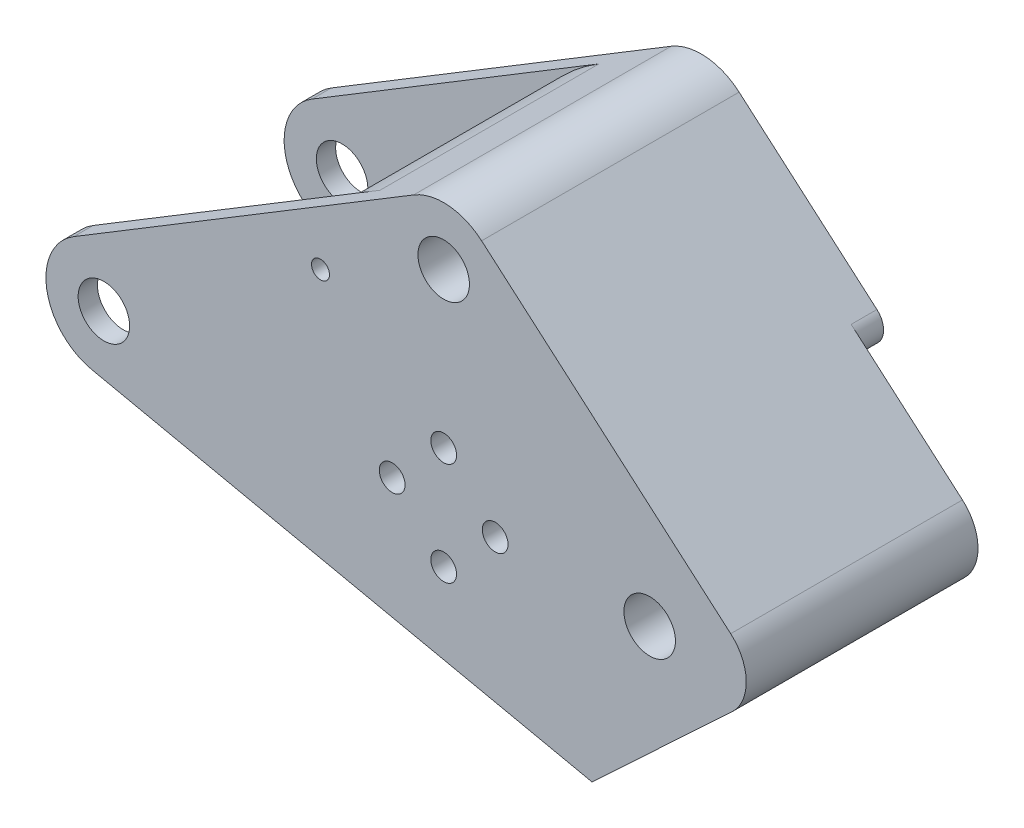
ISO-10303-21;
HEADER;
FILE_DESCRIPTION(('STEP AP214'),'2;1');
FILE_NAME('part.step','',(''),(''),'','','');
FILE_SCHEMA(('AUTOMOTIVE_DESIGN { 1 0 10303 214 1 1 1 1 }'));
ENDSEC;
DATA;
#1=APPLICATION_CONTEXT('core data for automotive mechanical design processes');
#2=APPLICATION_PROTOCOL_DEFINITION('international standard','automotive_design',2000,#1);
#3=PRODUCT_CONTEXT('',#1,'mechanical');
#4=PRODUCT('Part','Part','',(#3));
#5=PRODUCT_RELATED_PRODUCT_CATEGORY('part','',(#4));
#6=PRODUCT_DEFINITION_FORMATION('','',#4);
#7=PRODUCT_DEFINITION_CONTEXT('part definition',#1,'design');
#8=PRODUCT_DEFINITION('design','',#6,#7);
#9=PRODUCT_DEFINITION_SHAPE('','',#8);
#10=(LENGTH_UNIT() NAMED_UNIT(*) SI_UNIT(.MILLI.,.METRE.));
#11=(NAMED_UNIT(*) PLANE_ANGLE_UNIT() SI_UNIT($,.RADIAN.));
#12=(NAMED_UNIT(*) SI_UNIT($,.STERADIAN.) SOLID_ANGLE_UNIT());
#13=UNCERTAINTY_MEASURE_WITH_UNIT(LENGTH_MEASURE(1.E-05),#10,'distance_accuracy_value','');
#14=(GEOMETRIC_REPRESENTATION_CONTEXT(3) GLOBAL_UNCERTAINTY_ASSIGNED_CONTEXT((#13)) GLOBAL_UNIT_ASSIGNED_CONTEXT((#10,
#11,#12)) REPRESENTATION_CONTEXT('',''));
#15=CARTESIAN_POINT('',(0.,0.,0.));
#16=DIRECTION('',(0.,0.,1.));
#17=DIRECTION('',(1.,0.,0.));
#18=AXIS2_PLACEMENT_3D('',#15,#16,#17);
#19=CARTESIAN_POINT('',(92.7846096908264,0.,20.));
#20=DIRECTION('',(0.,0.,-1.));
#21=DIRECTION('',(-1.,0.,0.));
#22=AXIS2_PLACEMENT_3D('',#19,#20,#21);
#23=CYLINDRICAL_SURFACE('',#22,7.);
#24=CARTESIAN_POINT('',(92.7846096908264,0.,-16.));
#25=DIRECTION('',(0.,0.,-1.));
#26=DIRECTION('',(-1.,0.,0.));
#27=AXIS2_PLACEMENT_3D('',#24,#25,#26);
#28=CIRCLE('',#27,7.);
#29=CARTESIAN_POINT('',(97.3675554100697,5.29118214905415,-16.));
#30=VERTEX_POINT('',#29);
#31=CARTESIAN_POINT('',(97.5633187458234,-5.11506986928724,-16.));
#32=VERTEX_POINT('',#31);
#33=EDGE_CURVE('E147',#30,#32,#28,.T.);
#34=ORIENTED_EDGE('',*,*,#33,.F.);
#35=DIRECTION('',(0.,0.,-1.));
#36=VECTOR('',#35,1.);
#37=CARTESIAN_POINT('',(97.3675554100697,5.29118214905415,20.));
#38=LINE('',#37,#36);
#39=CARTESIAN_POINT('',(97.3675554100697,5.29118214905415,20.));
#40=VERTEX_POINT('',#39);
#41=EDGE_CURVE('E158',#40,#30,#38,.T.);
#42=ORIENTED_EDGE('',*,*,#41,.F.);
#43=CARTESIAN_POINT('',(92.7846096908264,0.,20.));
#44=DIRECTION('',(0.,0.,1.));
#45=DIRECTION('',(-1.,0.,0.));
#46=AXIS2_PLACEMENT_3D('',#43,#44,#45);
#47=CIRCLE('',#46,7.);
#48=CARTESIAN_POINT('',(97.5633187458234,-5.11506986928724,20.));
#49=VERTEX_POINT('',#48);
#50=EDGE_CURVE('E296',#49,#40,#47,.T.);
#51=ORIENTED_EDGE('',*,*,#50,.F.);
#52=DIRECTION('',(0.,0.,-1.));
#53=VECTOR('',#52,1.);
#54=CARTESIAN_POINT('',(97.5633187458234,-5.11506986928724,20.));
#55=LINE('',#54,#53);
#56=EDGE_CURVE('E161',#49,#32,#55,.T.);
#57=ORIENTED_EDGE('',*,*,#56,.T.);
#58=EDGE_LOOP('',(#34,#42,#51,#57));
#59=FACE_BOUND('',#58,.T.);
#60=ADVANCED_FACE('F40',(#59),#23,.T.);
#61=CARTESIAN_POINT('',(84.7846096908264,0.,20.));
#62=DIRECTION('',(0.,0.,-1.));
#63=DIRECTION('',(-1.,0.,0.));
#64=AXIS2_PLACEMENT_3D('',#61,#62,#63);
#65=CYLINDRICAL_SURFACE('',#64,4.00000000000001);
#66=CARTESIAN_POINT('',(84.7846096908264,0.,20.));
#67=DIRECTION('',(0.,0.,1.));
#68=DIRECTION('',(1.,0.,0.));
#69=AXIS2_PLACEMENT_3D('',#66,#67,#68);
#70=CIRCLE('',#69,4.00000000000001);
#71=CARTESIAN_POINT('',(88.7846096908264,0.,20.));
#72=VERTEX_POINT('',#71);
#73=EDGE_CURVE('E318',#72,#72,#70,.T.);
#74=ORIENTED_EDGE('',*,*,#73,.T.);
#75=EDGE_LOOP('',(#74));
#76=FACE_BOUND('',#75,.T.);
#77=CARTESIAN_POINT('',(84.7846096908264,0.,-16.));
#78=DIRECTION('',(0.,0.,-1.));
#79=DIRECTION('',(-1.,0.,0.));
#80=AXIS2_PLACEMENT_3D('',#77,#78,#79);
#81=CIRCLE('',#80,4.00000000000001);
#82=CARTESIAN_POINT('',(80.7846096908264,0.,-16.));
#83=VERTEX_POINT('',#82);
#84=EDGE_CURVE('E224',#83,#83,#81,.T.);
#85=ORIENTED_EDGE('',*,*,#84,.T.);
#86=EDGE_LOOP('',(#85));
#87=FACE_BOUND('',#86,.T.);
#88=ADVANCED_FACE('F474',(#76,#87),#65,.F.);
#89=CARTESIAN_POINT('',(60.7846096908264,0.,20.));
#90=DIRECTION('',(0.,0.,-1.));
#91=DIRECTION('',(-1.,0.,0.));
#92=AXIS2_PLACEMENT_3D('',#89,#90,#91);
#93=CYLINDRICAL_SURFACE('',#92,2.);
#94=CARTESIAN_POINT('',(60.7846096908264,0.,20.));
#95=DIRECTION('',(0.,0.,1.));
#96=DIRECTION('',(1.,0.,0.));
#97=AXIS2_PLACEMENT_3D('',#94,#95,#96);
#98=CIRCLE('',#97,2.);
#99=CARTESIAN_POINT('',(62.7846096908264,0.,20.));
#100=VERTEX_POINT('',#99);
#101=EDGE_CURVE('E325',#100,#100,#98,.T.);
#102=ORIENTED_EDGE('',*,*,#101,.T.);
#103=EDGE_LOOP('',(#102));
#104=FACE_BOUND('',#103,.T.);
#105=CARTESIAN_POINT('',(60.7846096908264,0.,17.));
#106=DIRECTION('',(0.,0.,-1.));
#107=DIRECTION('',(-1.,0.,0.));
#108=AXIS2_PLACEMENT_3D('',#105,#106,#107);
#109=CIRCLE('',#108,2.);
#110=CARTESIAN_POINT('',(58.7846096908264,0.,17.));
#111=VERTEX_POINT('',#110);
#112=EDGE_CURVE('E219',#111,#111,#109,.T.);
#113=ORIENTED_EDGE('',*,*,#112,.T.);
#114=EDGE_LOOP('',(#113));
#115=FACE_BOUND('',#114,.T.);
#116=ADVANCED_FACE('F480',(#104,#115),#93,.F.);
#117=CARTESIAN_POINT('',(52.7846096908264,-8.,20.));
#118=DIRECTION('',(0.,0.,-1.));
#119=DIRECTION('',(-1.,0.,0.));
#120=AXIS2_PLACEMENT_3D('',#117,#118,#119);
#121=CYLINDRICAL_SURFACE('',#120,2.);
#122=CARTESIAN_POINT('',(52.7846096908264,-8.,20.));
#123=DIRECTION('',(0.,0.,1.));
#124=DIRECTION('',(1.,0.,0.));
#125=AXIS2_PLACEMENT_3D('',#122,#123,#124);
#126=CIRCLE('',#125,2.);
#127=CARTESIAN_POINT('',(54.7846096908264,-8.,20.));
#128=VERTEX_POINT('',#127);
#129=EDGE_CURVE('E329',#128,#128,#126,.T.);
#130=ORIENTED_EDGE('',*,*,#129,.T.);
#131=EDGE_LOOP('',(#130));
#132=FACE_BOUND('',#131,.T.);
#133=CARTESIAN_POINT('',(52.7846096908264,-8.,17.));
#134=DIRECTION('',(0.,0.,-1.));
#135=DIRECTION('',(-1.,0.,0.));
#136=AXIS2_PLACEMENT_3D('',#133,#134,#135);
#137=CIRCLE('',#136,2.);
#138=CARTESIAN_POINT('',(50.7846096908264,-8.,17.));
#139=VERTEX_POINT('',#138);
#140=EDGE_CURVE('E215',#139,#139,#137,.T.);
#141=ORIENTED_EDGE('',*,*,#140,.T.);
#142=EDGE_LOOP('',(#141));
#143=FACE_BOUND('',#142,.T.);
#144=ADVANCED_FACE('F671',(#132,#143),#121,.F.);
#145=CARTESIAN_POINT('',(44.7846096908264,0.,20.));
#146=DIRECTION('',(0.,0.,-1.));
#147=DIRECTION('',(-1.,0.,0.));
#148=AXIS2_PLACEMENT_3D('',#145,#146,#147);
#149=CYLINDRICAL_SURFACE('',#148,2.);
#150=CARTESIAN_POINT('',(44.7846096908264,0.,20.));
#151=DIRECTION('',(0.,0.,1.));
#152=DIRECTION('',(1.,0.,0.));
#153=AXIS2_PLACEMENT_3D('',#150,#151,#152);
#154=CIRCLE('',#153,2.);
#155=CARTESIAN_POINT('',(46.7846096908264,0.,20.));
#156=VERTEX_POINT('',#155);
#157=EDGE_CURVE('E333',#156,#156,#154,.T.);
#158=ORIENTED_EDGE('',*,*,#157,.T.);
#159=EDGE_LOOP('',(#158));
#160=FACE_BOUND('',#159,.T.);
#161=CARTESIAN_POINT('',(44.7846096908264,0.,17.));
#162=DIRECTION('',(0.,0.,-1.));
#163=DIRECTION('',(-1.,0.,0.));
#164=AXIS2_PLACEMENT_3D('',#161,#162,#163);
#165=CIRCLE('',#164,2.);
#166=CARTESIAN_POINT('',(42.7846096908264,0.,17.));
#167=VERTEX_POINT('',#166);
#168=EDGE_CURVE('E210',#167,#167,#165,.T.);
#169=ORIENTED_EDGE('',*,*,#168,.T.);
#170=EDGE_LOOP('',(#169));
#171=FACE_BOUND('',#170,.T.);
#172=ADVANCED_FACE('F660',(#160,#171),#149,.F.);
#173=CARTESIAN_POINT('',(52.7846096908264,8.,20.));
#174=DIRECTION('',(0.,0.,-1.));
#175=DIRECTION('',(-1.,0.,0.));
#176=AXIS2_PLACEMENT_3D('',#173,#174,#175);
#177=CYLINDRICAL_SURFACE('',#176,2.);
#178=CARTESIAN_POINT('',(52.7846096908264,8.,20.));
#179=DIRECTION('',(0.,0.,1.));
#180=DIRECTION('',(1.,0.,0.));
#181=AXIS2_PLACEMENT_3D('',#178,#179,#180);
#182=CIRCLE('',#181,2.);
#183=CARTESIAN_POINT('',(54.7846096908264,8.,20.));
#184=VERTEX_POINT('',#183);
#185=EDGE_CURVE('E337',#184,#184,#182,.T.);
#186=ORIENTED_EDGE('',*,*,#185,.T.);
#187=EDGE_LOOP('',(#186));
#188=FACE_BOUND('',#187,.T.);
#189=CARTESIAN_POINT('',(52.7846096908264,8.,17.));
#190=DIRECTION('',(0.,0.,-1.));
#191=DIRECTION('',(-1.,0.,0.));
#192=AXIS2_PLACEMENT_3D('',#189,#190,#191);
#193=CIRCLE('',#192,2.);
#194=CARTESIAN_POINT('',(50.7846096908264,8.,17.));
#195=VERTEX_POINT('',#194);
#196=EDGE_CURVE('E206',#195,#195,#193,.T.);
#197=ORIENTED_EDGE('',*,*,#196,.T.);
#198=EDGE_LOOP('',(#197));
#199=FACE_BOUND('',#198,.T.);
#200=ADVANCED_FACE('F560',(#188,#199),#177,.F.);
#201=CARTESIAN_POINT('',(0.,0.,20.));
#202=DIRECTION('',(0.,0.,-1.));
#203=DIRECTION('',(-1.,0.,0.));
#204=AXIS2_PLACEMENT_3D('',#201,#202,#203);
#205=CYLINDRICAL_SURFACE('',#204,9.);
#206=CARTESIAN_POINT('',(0.,0.,17.));
#207=DIRECTION('',(0.,0.,-1.));
#208=DIRECTION('',(-1.,0.,0.));
#209=AXIS2_PLACEMENT_3D('',#206,#207,#208);
#210=CIRCLE('',#209,9.);
#211=CARTESIAN_POINT('',(-1.88266355773182,-8.80088506505957,17.));
#212=VERTEX_POINT('',#211);
#213=CARTESIAN_POINT('',(-4.66571004229143,7.69617760977883,17.));
#214=VERTEX_POINT('',#213);
#215=EDGE_CURVE('E369',#212,#214,#210,.T.);
#216=ORIENTED_EDGE('',*,*,#215,.F.);
#217=DIRECTION('',(0.,0.,-1.));
#218=VECTOR('',#217,1.);
#219=CARTESIAN_POINT('',(-1.88266355773182,-8.80088506505957,20.));
#220=LINE('',#219,#218);
#221=CARTESIAN_POINT('',(-1.88266355773182,-8.80088506505957,20.));
#222=VERTEX_POINT('',#221);
#223=EDGE_CURVE('E182',#222,#212,#220,.T.);
#224=ORIENTED_EDGE('',*,*,#223,.F.);
#225=CARTESIAN_POINT('',(0.,0.,20.));
#226=DIRECTION('',(0.,0.,1.));
#227=DIRECTION('',(1.,0.,0.));
#228=AXIS2_PLACEMENT_3D('',#225,#226,#227);
#229=CIRCLE('',#228,9.);
#230=CARTESIAN_POINT('',(-4.66571004229143,7.69617760977883,20.));
#231=VERTEX_POINT('',#230);
#232=EDGE_CURVE('E305',#231,#222,#229,.T.);
#233=ORIENTED_EDGE('',*,*,#232,.F.);
#234=DIRECTION('',(0.,0.,-1.));
#235=VECTOR('',#234,1.);
#236=CARTESIAN_POINT('',(-4.66571004229143,7.69617760977883,20.));
#237=LINE('',#236,#235);
#238=EDGE_CURVE('E187',#231,#214,#237,.T.);
#239=ORIENTED_EDGE('',*,*,#238,.T.);
#240=EDGE_LOOP('',(#216,#224,#233,#239));
#241=FACE_BOUND('',#240,.T.);
#242=ADVANCED_FACE('F453',(#241),#205,.T.);
#243=CARTESIAN_POINT('',(0.,0.,20.));
#244=DIRECTION('',(0.,0.,-1.));
#245=DIRECTION('',(-1.,0.,0.));
#246=AXIS2_PLACEMENT_3D('',#243,#244,#245);
#247=CYLINDRICAL_SURFACE('',#246,4.);
#248=CARTESIAN_POINT('',(0.,0.,20.));
#249=DIRECTION('',(0.,0.,1.));
#250=DIRECTION('',(1.,0.,0.));
#251=AXIS2_PLACEMENT_3D('',#248,#249,#250);
#252=CIRCLE('',#251,4.);
#253=CARTESIAN_POINT('',(4.,0.,20.));
#254=VERTEX_POINT('',#253);
#255=EDGE_CURVE('E293',#254,#254,#252,.T.);
#256=ORIENTED_EDGE('',*,*,#255,.T.);
#257=EDGE_LOOP('',(#256));
#258=FACE_BOUND('',#257,.T.);
#259=CARTESIAN_POINT('',(0.,0.,17.));
#260=DIRECTION('',(0.,0.,-1.));
#261=DIRECTION('',(-1.,0.,0.));
#262=AXIS2_PLACEMENT_3D('',#259,#260,#261);
#263=CIRCLE('',#262,4.);
#264=CARTESIAN_POINT('',(-4.,0.,17.));
#265=VERTEX_POINT('',#264);
#266=EDGE_CURVE('E196',#265,#265,#263,.T.);
#267=ORIENTED_EDGE('',*,*,#266,.T.);
#268=EDGE_LOOP('',(#267));
#269=FACE_BOUND('',#268,.T.);
#270=ADVANCED_FACE('F550',(#258,#269),#247,.F.);
#271=CARTESIAN_POINT('',(52.7846096908264,32.,20.));
#272=DIRECTION('',(0.,0.,-1.));
#273=DIRECTION('',(-1.,0.,0.));
#274=AXIS2_PLACEMENT_3D('',#271,#272,#273);
#275=PLANE('',#274);
#276=CARTESIAN_POINT('',(33.6505385165715,22.4274692323008,20.));
#277=DIRECTION('',(0.,0.,1.));
#278=DIRECTION('',(1.,0.,0.));
#279=AXIS2_PLACEMENT_3D('',#276,#277,#278);
#280=CIRCLE('',#279,1.395);
#281=CARTESIAN_POINT('',(35.0455385165715,22.4274692323008,20.));
#282=VERTEX_POINT('',#281);
#283=EDGE_CURVE('E228',#282,#282,#280,.T.);
#284=ORIENTED_EDGE('',*,*,#283,.F.);
#285=EDGE_LOOP('',(#284));
#286=FACE_BOUND('',#285,.T.);
#287=CARTESIAN_POINT('',(52.7846096908264,32.,20.));
#288=DIRECTION('',(0.,0.,1.));
#289=DIRECTION('',(-1.,0.,0.));
#290=AXIS2_PLACEMENT_3D('',#287,#288,#289);
#291=CIRCLE('',#290,9.);
#292=CARTESIAN_POINT('',(58.6769684727107,38.8029484773553,20.));
#293=VERTEX_POINT('',#292);
#294=CARTESIAN_POINT('',(48.118899648535,39.6961776097788,20.));
#295=VERTEX_POINT('',#294);
#296=EDGE_CURVE('E278',#293,#295,#291,.T.);
#297=ORIENTED_EDGE('',*,*,#296,.T.);
#298=DIRECTION('',(-0.855130845530981,-0.51841222692127,0.));
#299=VECTOR('',#298,1.);
#300=CARTESIAN_POINT('',(-4.66571004229143,7.69617760977883,20.));
#301=LINE('',#300,#299);
#302=EDGE_CURVE('E308',#295,#231,#301,.T.);
#303=ORIENTED_EDGE('',*,*,#302,.T.);
#304=ORIENTED_EDGE('',*,*,#232,.T.);
#305=DIRECTION('',(0.977876118339952,-0.20918483974798,0.));
#306=VECTOR('',#305,1.);
#307=CARTESIAN_POINT('',(-1.88266355773182,-8.80088506505957,20.));
#308=LINE('',#307,#306);
#309=CARTESIAN_POINT('',(75.8249885494009,-25.4239137374617,20.));
#310=VERTEX_POINT('',#309);
#311=EDGE_CURVE('E302',#222,#310,#308,.T.);
#312=ORIENTED_EDGE('',*,*,#311,.T.);
#313=DIRECTION('',(0.730724267041033,0.682672722142422,0.));
#314=VECTOR('',#313,1.);
#315=CARTESIAN_POINT('',(97.5633187458234,-5.11506986928723,20.));
#316=LINE('',#315,#314);
#317=EDGE_CURVE('E299',#310,#49,#316,.T.);
#318=ORIENTED_EDGE('',*,*,#317,.T.);
#319=ORIENTED_EDGE('',*,*,#50,.T.);
#320=DIRECTION('',(-0.755883164150593,0.654706531320475,0.));
#321=VECTOR('',#320,1.);
#322=CARTESIAN_POINT('',(58.6769684727107,38.8029484773553,20.));
#323=LINE('',#322,#321);
#324=EDGE_CURVE('E166',#40,#293,#323,.T.);
#325=ORIENTED_EDGE('',*,*,#324,.T.);
#326=EDGE_LOOP('',(#297,#303,#304,#312,#318,#319,#325));
#327=FACE_BOUND('',#326,.T.);
#328=ORIENTED_EDGE('',*,*,#255,.F.);
#329=EDGE_LOOP('',(#328));
#330=FACE_BOUND('',#329,.T.);
#331=ORIENTED_EDGE('',*,*,#73,.F.);
#332=EDGE_LOOP('',(#331));
#333=FACE_BOUND('',#332,.T.);
#334=ORIENTED_EDGE('',*,*,#101,.F.);
#335=EDGE_LOOP('',(#334));
#336=FACE_BOUND('',#335,.T.);
#337=ORIENTED_EDGE('',*,*,#129,.F.);
#338=EDGE_LOOP('',(#337));
#339=FACE_BOUND('',#338,.T.);
#340=ORIENTED_EDGE('',*,*,#157,.F.);
#341=EDGE_LOOP('',(#340));
#342=FACE_BOUND('',#341,.T.);
#343=ORIENTED_EDGE('',*,*,#185,.F.);
#344=EDGE_LOOP('',(#343));
#345=FACE_BOUND('',#344,.T.);
#346=CARTESIAN_POINT('',(52.7846096908264,32.,20.));
#347=DIRECTION('',(0.,0.,1.));
#348=DIRECTION('',(1.,0.,0.));
#349=AXIS2_PLACEMENT_3D('',#346,#347,#348);
#350=CIRCLE('',#349,4.00000000000001);
#351=CARTESIAN_POINT('',(56.7846096908264,32.,20.));
#352=VERTEX_POINT('',#351);
#353=EDGE_CURVE('E341',#352,#352,#350,.T.);
#354=ORIENTED_EDGE('',*,*,#353,.F.);
#355=EDGE_LOOP('',(#354));
#356=FACE_BOUND('',#355,.T.);
#357=ADVANCED_FACE('F431',(#286,#327,#330,#333,#336,#339,#342,#345,#356),#275,.F.);
#358=CARTESIAN_POINT('',(52.7846096908264,32.,-20.));
#359=DIRECTION('',(0.,0.,-1.));
#360=DIRECTION('',(-1.,0.,0.));
#361=AXIS2_PLACEMENT_3D('',#358,#359,#360);
#362=PLANE('',#361);
#363=CARTESIAN_POINT('',(84.7846096908264,0.,-20.));
#364=DIRECTION('',(0.,0.,-1.));
#365=DIRECTION('',(-1.,0.,0.));
#366=AXIS2_PLACEMENT_3D('',#363,#364,#365);
#367=CIRCLE('',#366,16.1898727620367);
#368=CARTESIAN_POINT('',(79.9414155285967,-15.4484772828225,-20.));
#369=VERTEX_POINT('',#368);
#370=CARTESIAN_POINT('',(79.1606317065131,15.1816616904375,-20.));
#371=VERTEX_POINT('',#370);
#372=EDGE_CURVE('E258',#369,#371,#367,.T.);
#373=ORIENTED_EDGE('',*,*,#372,.F.);
#374=CARTESIAN_POINT('',(79.0439666912742,-18.3110959413917,-20.));
#375=DIRECTION('',(0.,0.,-1.));
#376=DIRECTION('',(-1.,0.,0.));
#377=AXIS2_PLACEMENT_3D('',#374,#375,#376);
#378=CIRCLE('',#377,3.);
#379=CARTESIAN_POINT('',(81.0919848577015,-20.5032687425148,-20.));
#380=VERTEX_POINT('',#379);
#381=EDGE_CURVE('E238',#369,#380,#378,.T.);
#382=ORIENTED_EDGE('',*,*,#381,.T.);
#383=DIRECTION('',(0.730724267041033,0.682672722142422,0.));
#384=VECTOR('',#383,1.);
#385=CARTESIAN_POINT('',(97.5633187458234,-5.11506986928723,-20.));
#386=LINE('',#385,#384);
#387=CARTESIAN_POINT('',(75.8249885494009,-25.4239137374617,-20.));
#388=VERTEX_POINT('',#387);
#389=EDGE_CURVE('E267',#388,#380,#386,.T.);
#390=ORIENTED_EDGE('',*,*,#389,.F.);
#391=DIRECTION('',(0.977876118339952,-0.20918483974798,0.));
#392=VECTOR('',#391,1.);
#393=CARTESIAN_POINT('',(-1.88266355773182,-8.80088506505957,-20.));
#394=LINE('',#393,#392);
#395=CARTESIAN_POINT('',(-1.88266355773182,-8.80088506505957,-20.));
#396=VERTEX_POINT('',#395);
#397=EDGE_CURVE('E274',#396,#388,#394,.T.);
#398=ORIENTED_EDGE('',*,*,#397,.F.);
#399=CARTESIAN_POINT('',(0.,0.,-20.));
#400=DIRECTION('',(0.,0.,1.));
#401=DIRECTION('',(1.,0.,0.));
#402=AXIS2_PLACEMENT_3D('',#399,#400,#401);
#403=CIRCLE('',#402,9.);
#404=CARTESIAN_POINT('',(-4.66571004229143,7.69617760977883,-20.));
#405=VERTEX_POINT('',#404);
#406=EDGE_CURVE('E279',#405,#396,#403,.T.);
#407=ORIENTED_EDGE('',*,*,#406,.F.);
#408=DIRECTION('',(-0.855130845530981,-0.51841222692127,0.));
#409=VECTOR('',#408,1.);
#410=CARTESIAN_POINT('',(-4.66571004229143,7.69617760977883,-20.));
#411=LINE('',#410,#409);
#412=CARTESIAN_POINT('',(48.118899648535,39.6961776097788,-20.));
#413=VERTEX_POINT('',#412);
#414=EDGE_CURVE('E285',#413,#405,#411,.T.);
#415=ORIENTED_EDGE('',*,*,#414,.F.);
#416=CARTESIAN_POINT('',(52.7846096908264,32.,-20.));
#417=DIRECTION('',(0.,0.,1.));
#418=DIRECTION('',(-1.,0.,0.));
#419=AXIS2_PLACEMENT_3D('',#416,#417,#418);
#420=CIRCLE('',#419,9.);
#421=CARTESIAN_POINT('',(58.6769684727107,38.8029484773553,-20.));
#422=VERTEX_POINT('',#421);
#423=EDGE_CURVE('E289',#422,#413,#420,.T.);
#424=ORIENTED_EDGE('',*,*,#423,.F.);
#425=DIRECTION('',(-0.755883164150593,0.654706531320475,0.));
#426=VECTOR('',#425,1.);
#427=CARTESIAN_POINT('',(58.6769684727107,38.8029484773553,-20.));
#428=LINE('',#427,#426);
#429=CARTESIAN_POINT('',(80.0826224214569,20.2624886389907,-20.));
#430=VERTEX_POINT('',#429);
#431=EDGE_CURVE('E273',#430,#422,#428,.T.);
#432=ORIENTED_EDGE('',*,*,#431,.F.);
#433=CARTESIAN_POINT('',(78.1185028274955,17.9948391465389,-20.));
#434=DIRECTION('',(0.,0.,-1.));
#435=DIRECTION('',(-1.,0.,0.));
#436=AXIS2_PLACEMENT_3D('',#433,#434,#435);
#437=CIRCLE('',#436,3.);
#438=EDGE_CURVE('E235',#430,#371,#437,.T.);
#439=ORIENTED_EDGE('',*,*,#438,.T.);
#440=EDGE_LOOP('',(#373,#382,#390,#398,#407,#415,#424,#432,#439));
#441=FACE_BOUND('',#440,.T.);
#442=CARTESIAN_POINT('',(33.6505385165715,22.4274692323008,-20.));
#443=DIRECTION('',(0.,0.,1.));
#444=DIRECTION('',(1.,0.,0.));
#445=AXIS2_PLACEMENT_3D('',#442,#443,#444);
#446=CIRCLE('',#445,1.395);
#447=CARTESIAN_POINT('',(35.0455385165715,22.4274692323008,-20.));
#448=VERTEX_POINT('',#447);
#449=EDGE_CURVE('E412',#448,#448,#446,.T.);
#450=ORIENTED_EDGE('',*,*,#449,.T.);
#451=EDGE_LOOP('',(#450));
#452=FACE_BOUND('',#451,.T.);
#453=CARTESIAN_POINT('',(44.7846096908264,0.,-20.));
#454=DIRECTION('',(0.,0.,-1.));
#455=DIRECTION('',(-1.,0.,0.));
#456=AXIS2_PLACEMENT_3D('',#453,#454,#455);
#457=CIRCLE('',#456,4.00000000000001);
#458=CARTESIAN_POINT('',(40.7846096908264,0.,-20.));
#459=VERTEX_POINT('',#458);
#460=EDGE_CURVE('E400',#459,#459,#457,.T.);
#461=ORIENTED_EDGE('',*,*,#460,.F.);
#462=EDGE_LOOP('',(#461));
#463=FACE_BOUND('',#462,.T.);
#464=CARTESIAN_POINT('',(52.7846096908264,-8.,-20.));
#465=DIRECTION('',(0.,0.,-1.));
#466=DIRECTION('',(-1.,0.,0.));
#467=AXIS2_PLACEMENT_3D('',#464,#465,#466);
#468=CIRCLE('',#467,4.00000000000001);
#469=CARTESIAN_POINT('',(48.7846096908264,-8.,-20.));
#470=VERTEX_POINT('',#469);
#471=EDGE_CURVE('E392',#470,#470,#468,.T.);
#472=ORIENTED_EDGE('',*,*,#471,.F.);
#473=EDGE_LOOP('',(#472));
#474=FACE_BOUND('',#473,.T.);
#475=CARTESIAN_POINT('',(52.7846096908264,8.,-20.));
#476=DIRECTION('',(0.,0.,-1.));
#477=DIRECTION('',(-1.,0.,0.));
#478=AXIS2_PLACEMENT_3D('',#475,#476,#477);
#479=CIRCLE('',#478,4.00000000000001);
#480=CARTESIAN_POINT('',(48.7846096908264,8.,-20.));
#481=VERTEX_POINT('',#480);
#482=EDGE_CURVE('E408',#481,#481,#479,.T.);
#483=ORIENTED_EDGE('',*,*,#482,.F.);
#484=EDGE_LOOP('',(#483));
#485=FACE_BOUND('',#484,.T.);
#486=CARTESIAN_POINT('',(60.7846096908264,0.,-20.));
#487=DIRECTION('',(0.,0.,-1.));
#488=DIRECTION('',(-1.,0.,0.));
#489=AXIS2_PLACEMENT_3D('',#486,#487,#488);
#490=CIRCLE('',#489,4.00000000000001);
#491=CARTESIAN_POINT('',(56.7846096908264,0.,-20.));
#492=VERTEX_POINT('',#491);
#493=EDGE_CURVE('E384',#492,#492,#490,.T.);
#494=ORIENTED_EDGE('',*,*,#493,.F.);
#495=EDGE_LOOP('',(#494));
#496=FACE_BOUND('',#495,.T.);
#497=CARTESIAN_POINT('',(0.,0.,-20.));
#498=DIRECTION('',(0.,0.,1.));
#499=DIRECTION('',(1.,0.,0.));
#500=AXIS2_PLACEMENT_3D('',#497,#498,#499);
#501=CIRCLE('',#500,4.);
#502=CARTESIAN_POINT('',(4.,0.,-20.));
#503=VERTEX_POINT('',#502);
#504=EDGE_CURVE('E314',#503,#503,#501,.T.);
#505=ORIENTED_EDGE('',*,*,#504,.T.);
#506=EDGE_LOOP('',(#505));
#507=FACE_BOUND('',#506,.T.);
#508=CARTESIAN_POINT('',(52.7846096908264,32.,-20.));
#509=DIRECTION('',(0.,0.,1.));
#510=DIRECTION('',(1.,0.,0.));
#511=AXIS2_PLACEMENT_3D('',#508,#509,#510);
#512=CIRCLE('',#511,4.00000000000001);
#513=CARTESIAN_POINT('',(56.7846096908264,32.,-20.));
#514=VERTEX_POINT('',#513);
#515=EDGE_CURVE('E205',#514,#514,#512,.T.);
#516=ORIENTED_EDGE('',*,*,#515,.T.);
#517=EDGE_LOOP('',(#516));
#518=FACE_BOUND('',#517,.T.);
#519=ADVANCED_FACE('F264',(#441,#452,#463,#474,#485,#496,#507,#518),#362,.T.);
#520=CARTESIAN_POINT('',(52.7846096908264,32.,20.));
#521=DIRECTION('',(0.,0.,-1.));
#522=DIRECTION('',(-1.,0.,0.));
#523=AXIS2_PLACEMENT_3D('',#520,#521,#522);
#524=CYLINDRICAL_SURFACE('',#523,9.);
#525=ORIENTED_EDGE('',*,*,#423,.T.);
#526=DIRECTION('',(0.,0.,-1.));
#527=VECTOR('',#526,1.);
#528=CARTESIAN_POINT('',(48.118899648535,39.6961776097788,20.));
#529=LINE('',#528,#527);
#530=EDGE_CURVE('E191',#295,#413,#529,.T.);
#531=ORIENTED_EDGE('',*,*,#530,.F.);
#532=ORIENTED_EDGE('',*,*,#296,.F.);
#533=DIRECTION('',(0.,0.,-1.));
#534=VECTOR('',#533,1.);
#535=CARTESIAN_POINT('',(58.6769684727107,38.8029484773553,20.));
#536=LINE('',#535,#534);
#537=EDGE_CURVE('E168',#293,#422,#536,.T.);
#538=ORIENTED_EDGE('',*,*,#537,.T.);
#539=EDGE_LOOP('',(#525,#531,#532,#538));
#540=FACE_BOUND('',#539,.T.);
#541=ADVANCED_FACE('F428',(#540),#524,.T.);
#542=CARTESIAN_POINT('',(-4.66571004229143,7.69617760977883,20.));
#543=DIRECTION('',(0.51841222692127,-0.855130845530981,0.));
#544=DIRECTION('',(0.855130845530981,0.51841222692127,0.));
#545=AXIS2_PLACEMENT_3D('',#542,#543,#544);
#546=PLANE('',#545);
#547=CARTESIAN_POINT('',(-4.66571004229143,7.69617760977883,-17.));
#548=VERTEX_POINT('',#547);
#549=EDGE_CURVE('E186',#548,#405,#237,.T.);
#550=ORIENTED_EDGE('',*,*,#549,.F.);
#551=DIRECTION('',(-0.855130845530981,-0.51841222692127,0.));
#552=VECTOR('',#551,1.);
#553=CARTESIAN_POINT('',(-4.66571004229143,7.69617760977883,-17.));
#554=LINE('',#553,#552);
#555=CARTESIAN_POINT('',(39.8918886883294,34.7086565829381,-17.));
#556=VERTEX_POINT('',#555);
#557=EDGE_CURVE('E358',#556,#548,#554,.T.);
#558=ORIENTED_EDGE('',*,*,#557,.F.);
#559=DIRECTION('',(0.,0.,1.));
#560=VECTOR('',#559,1.);
#561=CARTESIAN_POINT('',(39.8918886883294,34.7086565829381,-99.5775573065256));
#562=LINE('',#561,#560);
#563=CARTESIAN_POINT('',(39.8918886883294,34.7086565829381,17.));
#564=VERTEX_POINT('',#563);
#565=EDGE_CURVE('E354',#556,#564,#562,.T.);
#566=ORIENTED_EDGE('',*,*,#565,.T.);
#567=DIRECTION('',(0.855130845530981,0.51841222692127,0.));
#568=VECTOR('',#567,1.);
#569=CARTESIAN_POINT('',(-4.66571004229143,7.69617760977883,17.));
#570=LINE('',#569,#568);
#571=EDGE_CURVE('E223',#214,#564,#570,.T.);
#572=ORIENTED_EDGE('',*,*,#571,.F.);
#573=ORIENTED_EDGE('',*,*,#238,.F.);
#574=ORIENTED_EDGE('',*,*,#302,.F.);
#575=ORIENTED_EDGE('',*,*,#530,.T.);
#576=ORIENTED_EDGE('',*,*,#414,.T.);
#577=EDGE_LOOP('',(#550,#558,#566,#572,#573,#574,#575,#576));
#578=FACE_BOUND('',#577,.T.);
#579=ADVANCED_FACE('F449',(#578),#546,.F.);
#580=CARTESIAN_POINT('',(-1.88266355773182,-8.80088506505957,-17.));
#581=VERTEX_POINT('',#580);
#582=EDGE_CURVE('E181',#581,#396,#220,.T.);
#583=ORIENTED_EDGE('',*,*,#582,.F.);
#584=CARTESIAN_POINT('',(0.,0.,-17.));
#585=DIRECTION('',(0.,0.,-1.));
#586=DIRECTION('',(-1.,0.,0.));
#587=AXIS2_PLACEMENT_3D('',#584,#585,#586);
#588=CIRCLE('',#587,9.);
#589=EDGE_CURVE('E201',#548,#581,#588,.F.);
#590=ORIENTED_EDGE('',*,*,#589,.F.);
#591=ORIENTED_EDGE('',*,*,#549,.T.);
#592=ORIENTED_EDGE('',*,*,#406,.T.);
#593=EDGE_LOOP('',(#583,#590,#591,#592));
#594=FACE_BOUND('',#593,.T.);
#595=ADVANCED_FACE('F443',(#594),#205,.T.);
#596=CARTESIAN_POINT('',(-1.88266355773182,-8.80088506505957,20.));
#597=DIRECTION('',(0.20918483974798,0.977876118339952,0.));
#598=DIRECTION('',(-0.977876118339952,0.20918483974798,0.));
#599=AXIS2_PLACEMENT_3D('',#596,#597,#598);
#600=PLANE('',#599);
#601=DIRECTION('',(0.,0.,1.));
#602=VECTOR('',#601,1.);
#603=CARTESIAN_POINT('',(49.0707220170727,-19.7007072369894,-99.5775573065256));
#604=LINE('',#603,#602);
#605=CARTESIAN_POINT('',(49.0707220170727,-19.7007072369894,-17.));
#606=VERTEX_POINT('',#605);
#607=CARTESIAN_POINT('',(49.0707220170727,-19.7007072369894,17.));
#608=VERTEX_POINT('',#607);
#609=EDGE_CURVE('E348',#606,#608,#604,.T.);
#610=ORIENTED_EDGE('',*,*,#609,.F.);
#611=DIRECTION('',(0.977876118339952,-0.20918483974798,0.));
#612=VECTOR('',#611,1.);
#613=CARTESIAN_POINT('',(-1.88266355773182,-8.80088506505957,-17.));
#614=LINE('',#613,#612);
#615=EDGE_CURVE('E353',#581,#606,#614,.T.);
#616=ORIENTED_EDGE('',*,*,#615,.F.);
#617=ORIENTED_EDGE('',*,*,#582,.T.);
#618=ORIENTED_EDGE('',*,*,#397,.T.);
#619=DIRECTION('',(0.,0.,-1.));
#620=VECTOR('',#619,1.);
#621=CARTESIAN_POINT('',(75.8249885494009,-25.4239137374617,20.));
#622=LINE('',#621,#620);
#623=EDGE_CURVE('E172',#310,#388,#622,.T.);
#624=ORIENTED_EDGE('',*,*,#623,.F.);
#625=ORIENTED_EDGE('',*,*,#311,.F.);
#626=ORIENTED_EDGE('',*,*,#223,.T.);
#627=DIRECTION('',(-0.977876118339952,0.20918483974798,0.));
#628=VECTOR('',#627,1.);
#629=CARTESIAN_POINT('',(-1.88266355773182,-8.80088506505957,17.));
#630=LINE('',#629,#628);
#631=EDGE_CURVE('E376',#608,#212,#630,.T.);
#632=ORIENTED_EDGE('',*,*,#631,.F.);
#633=EDGE_LOOP('',(#610,#616,#617,#618,#624,#625,#626,#632));
#634=FACE_BOUND('',#633,.T.);
#635=ADVANCED_FACE('F439',(#634),#600,.F.);
#636=CARTESIAN_POINT('',(97.5633187458234,-5.11506986928723,20.));
#637=DIRECTION('',(-0.682672722142422,0.730724267041033,0.));
#638=DIRECTION('',(-0.730724267041033,-0.682672722142422,0.));
#639=AXIS2_PLACEMENT_3D('',#636,#637,#638);
#640=PLANE('',#639);
#641=ORIENTED_EDGE('',*,*,#389,.T.);
#642=DIRECTION('',(0.,0.,-1.));
#643=VECTOR('',#642,1.);
#644=CARTESIAN_POINT('',(81.0919848577015,-20.5032687425148,20.));
#645=LINE('',#644,#643);
#646=CARTESIAN_POINT('',(81.0919848577015,-20.5032687425148,-16.));
#647=VERTEX_POINT('',#646);
#648=EDGE_CURVE('E241',#380,#647,#645,.F.);
#649=ORIENTED_EDGE('',*,*,#648,.T.);
#650=DIRECTION('',(-0.730724267041033,-0.682672722142422,0.));
#651=VECTOR('',#650,1.);
#652=CARTESIAN_POINT('',(97.5633187458234,-5.11506986928724,-16.));
#653=LINE('',#652,#651);
#654=EDGE_CURVE('E63',#32,#647,#653,.T.);
#655=ORIENTED_EDGE('',*,*,#654,.F.);
#656=ORIENTED_EDGE('',*,*,#56,.F.);
#657=ORIENTED_EDGE('',*,*,#317,.F.);
#658=ORIENTED_EDGE('',*,*,#623,.T.);
#659=EDGE_LOOP('',(#641,#649,#655,#656,#657,#658));
#660=FACE_BOUND('',#659,.T.);
#661=ADVANCED_FACE('F269',(#660),#640,.F.);
#662=CARTESIAN_POINT('',(58.6769684727107,38.8029484773553,20.));
#663=DIRECTION('',(-0.654706531320475,-0.755883164150593,0.));
#664=DIRECTION('',(0.755883164150593,-0.654706531320475,0.));
#665=AXIS2_PLACEMENT_3D('',#662,#663,#664);
#666=PLANE('',#665);
#667=DIRECTION('',(0.755883164150593,-0.654706531320475,0.));
#668=VECTOR('',#667,1.);
#669=CARTESIAN_POINT('',(97.3675554100697,5.29118214905415,-16.));
#670=LINE('',#669,#668);
#671=CARTESIAN_POINT('',(80.0826224214569,20.2624886389907,-16.));
#672=VERTEX_POINT('',#671);
#673=EDGE_CURVE('E56',#672,#30,#670,.T.);
#674=ORIENTED_EDGE('',*,*,#673,.F.);
#675=DIRECTION('',(0.,0.,-1.));
#676=VECTOR('',#675,1.);
#677=CARTESIAN_POINT('',(80.0826224214569,20.2624886389907,20.));
#678=LINE('',#677,#676);
#679=EDGE_CURVE('E244',#672,#430,#678,.T.);
#680=ORIENTED_EDGE('',*,*,#679,.T.);
#681=ORIENTED_EDGE('',*,*,#431,.T.);
#682=ORIENTED_EDGE('',*,*,#537,.F.);
#683=ORIENTED_EDGE('',*,*,#324,.F.);
#684=ORIENTED_EDGE('',*,*,#41,.T.);
#685=EDGE_LOOP('',(#674,#680,#681,#682,#683,#684));
#686=FACE_BOUND('',#685,.T.);
#687=ADVANCED_FACE('F164',(#686),#666,.F.);
#688=CARTESIAN_POINT('',(0.,0.,-17.));
#689=DIRECTION('',(0.,0.,-1.));
#690=DIRECTION('',(-1.,0.,0.));
#691=AXIS2_PLACEMENT_3D('',#688,#689,#690);
#692=CIRCLE('',#691,4.);
#693=CARTESIAN_POINT('',(-4.,0.,-17.));
#694=VERTEX_POINT('',#693);
#695=EDGE_CURVE('E200',#694,#694,#692,.T.);
#696=ORIENTED_EDGE('',*,*,#695,.F.);
#697=EDGE_LOOP('',(#696));
#698=FACE_BOUND('',#697,.T.);
#699=ORIENTED_EDGE('',*,*,#504,.F.);
#700=EDGE_LOOP('',(#699));
#701=FACE_BOUND('',#700,.T.);
#702=ADVANCED_FACE('F470',(#698,#701),#247,.F.);
#703=CARTESIAN_POINT('',(52.7846096908264,32.,20.));
#704=DIRECTION('',(0.,0.,-1.));
#705=DIRECTION('',(-1.,0.,0.));
#706=AXIS2_PLACEMENT_3D('',#703,#704,#705);
#707=CYLINDRICAL_SURFACE('',#706,4.00000000000001);
#708=ORIENTED_EDGE('',*,*,#353,.T.);
#709=EDGE_LOOP('',(#708));
#710=FACE_BOUND('',#709,.T.);
#711=ORIENTED_EDGE('',*,*,#515,.F.);
#712=EDGE_LOOP('',(#711));
#713=FACE_BOUND('',#712,.T.);
#714=ADVANCED_FACE('F462',(#710,#713),#707,.F.);
#715=CARTESIAN_POINT('',(52.7846096908264,32.,-17.));
#716=DIRECTION('',(0.,0.,-1.));
#717=DIRECTION('',(-1.,0.,0.));
#718=AXIS2_PLACEMENT_3D('',#715,#716,#717);
#719=PLANE('',#718);
#720=ORIENTED_EDGE('',*,*,#695,.T.);
#721=EDGE_LOOP('',(#720));
#722=FACE_BOUND('',#721,.T.);
#723=ORIENTED_EDGE('',*,*,#589,.T.);
#724=ORIENTED_EDGE('',*,*,#615,.T.);
#725=CARTESIAN_POINT('',(55.279980506427,9.32570594216057,-17.));
#726=DIRECTION('',(0.,0.,-1.));
#727=DIRECTION('',(-1.,0.,0.));
#728=AXIS2_PLACEMENT_3D('',#725,#726,#727);
#729=CIRCLE('',#728,29.6831189910082);
#730=EDGE_CURVE('E352',#606,#556,#729,.T.);
#731=ORIENTED_EDGE('',*,*,#730,.T.);
#732=ORIENTED_EDGE('',*,*,#557,.T.);
#733=EDGE_LOOP('',(#723,#724,#731,#732));
#734=FACE_BOUND('',#733,.T.);
#735=ADVANCED_FACE('F460',(#722,#734),#719,.F.);
#736=CARTESIAN_POINT('',(55.279980506427,9.32570594216057,-99.5775573065256));
#737=DIRECTION('',(0.,0.,1.));
#738=DIRECTION('',(1.,0.,0.));
#739=AXIS2_PLACEMENT_3D('',#736,#737,#738);
#740=CYLINDRICAL_SURFACE('',#739,29.6831189910082);
#741=ORIENTED_EDGE('',*,*,#609,.T.);
#742=CARTESIAN_POINT('',(55.279980506427,9.32570594216057,17.));
#743=DIRECTION('',(0.,0.,-1.));
#744=DIRECTION('',(-1.,0.,0.));
#745=AXIS2_PLACEMENT_3D('',#742,#743,#744);
#746=CIRCLE('',#745,29.6831189910082);
#747=EDGE_CURVE('E373',#564,#608,#746,.F.);
#748=ORIENTED_EDGE('',*,*,#747,.F.);
#749=ORIENTED_EDGE('',*,*,#565,.F.);
#750=ORIENTED_EDGE('',*,*,#730,.F.);
#751=EDGE_LOOP('',(#741,#748,#749,#750));
#752=FACE_BOUND('',#751,.T.);
#753=ADVANCED_FACE('F458',(#752),#740,.T.);
#754=CARTESIAN_POINT('',(52.7846096908264,32.,17.));
#755=DIRECTION('',(0.,0.,-1.));
#756=DIRECTION('',(-1.,0.,0.));
#757=AXIS2_PLACEMENT_3D('',#754,#755,#756);
#758=PLANE('',#757);
#759=ORIENTED_EDGE('',*,*,#266,.F.);
#760=EDGE_LOOP('',(#759));
#761=FACE_BOUND('',#760,.T.);
#762=ORIENTED_EDGE('',*,*,#631,.T.);
#763=ORIENTED_EDGE('',*,*,#215,.T.);
#764=ORIENTED_EDGE('',*,*,#571,.T.);
#765=ORIENTED_EDGE('',*,*,#747,.T.);
#766=EDGE_LOOP('',(#762,#763,#764,#765));
#767=FACE_BOUND('',#766,.T.);
#768=ADVANCED_FACE('F456',(#761,#767),#758,.T.);
#769=CARTESIAN_POINT('',(52.7846096908264,8.,31.3137084989848));
#770=DIRECTION('',(0.,0.,-1.));
#771=DIRECTION('',(-1.,0.,0.));
#772=AXIS2_PLACEMENT_3D('',#769,#770,#771);
#773=CYLINDRICAL_SURFACE('',#772,4.00000000000001);
#774=CARTESIAN_POINT('',(52.7846096908264,8.,17.));
#775=DIRECTION('',(0.,0.,-1.));
#776=DIRECTION('',(-1.,0.,0.));
#777=AXIS2_PLACEMENT_3D('',#774,#775,#776);
#778=CIRCLE('',#777,4.00000000000001);
#779=CARTESIAN_POINT('',(48.7846096908264,8.,17.));
#780=VERTEX_POINT('',#779);
#781=EDGE_CURVE('E404',#780,#780,#778,.F.);
#782=ORIENTED_EDGE('',*,*,#781,.T.);
#783=EDGE_LOOP('',(#782));
#784=FACE_BOUND('',#783,.T.);
#785=ORIENTED_EDGE('',*,*,#482,.T.);
#786=EDGE_LOOP('',(#785));
#787=FACE_BOUND('',#786,.T.);
#788=ADVANCED_FACE('F517',(#784,#787),#773,.F.);
#789=CARTESIAN_POINT('',(52.7846096908264,32.,17.));
#790=DIRECTION('',(0.,0.,-1.));
#791=DIRECTION('',(-1.,0.,0.));
#792=AXIS2_PLACEMENT_3D('',#789,#790,#791);
#793=PLANE('',#792);
#794=ORIENTED_EDGE('',*,*,#196,.F.);
#795=EDGE_LOOP('',(#794));
#796=FACE_BOUND('',#795,.T.);
#797=ORIENTED_EDGE('',*,*,#781,.F.);
#798=EDGE_LOOP('',(#797));
#799=FACE_BOUND('',#798,.T.);
#800=ADVANCED_FACE('F513',(#796,#799),#793,.T.);
#801=CARTESIAN_POINT('',(44.7846096908264,0.,31.3137084989848));
#802=DIRECTION('',(0.,0.,-1.));
#803=DIRECTION('',(-1.,0.,0.));
#804=AXIS2_PLACEMENT_3D('',#801,#802,#803);
#805=CYLINDRICAL_SURFACE('',#804,4.00000000000001);
#806=CARTESIAN_POINT('',(44.7846096908264,0.,17.));
#807=DIRECTION('',(0.,0.,-1.));
#808=DIRECTION('',(-1.,0.,0.));
#809=AXIS2_PLACEMENT_3D('',#806,#807,#808);
#810=CIRCLE('',#809,4.00000000000001);
#811=CARTESIAN_POINT('',(40.7846096908264,0.,17.));
#812=VERTEX_POINT('',#811);
#813=EDGE_CURVE('E396',#812,#812,#810,.F.);
#814=ORIENTED_EDGE('',*,*,#813,.T.);
#815=EDGE_LOOP('',(#814));
#816=FACE_BOUND('',#815,.T.);
#817=ORIENTED_EDGE('',*,*,#460,.T.);
#818=EDGE_LOOP('',(#817));
#819=FACE_BOUND('',#818,.T.);
#820=ADVANCED_FACE('F516',(#816,#819),#805,.F.);
#821=CARTESIAN_POINT('',(52.7846096908264,32.,17.));
#822=DIRECTION('',(0.,0.,-1.));
#823=DIRECTION('',(-1.,0.,0.));
#824=AXIS2_PLACEMENT_3D('',#821,#822,#823);
#825=PLANE('',#824);
#826=ORIENTED_EDGE('',*,*,#168,.F.);
#827=EDGE_LOOP('',(#826));
#828=FACE_BOUND('',#827,.T.);
#829=ORIENTED_EDGE('',*,*,#813,.F.);
#830=EDGE_LOOP('',(#829));
#831=FACE_BOUND('',#830,.T.);
#832=ADVANCED_FACE('F522',(#828,#831),#825,.T.);
#833=CARTESIAN_POINT('',(52.7846096908264,-8.,31.3137084989848));
#834=DIRECTION('',(0.,0.,-1.));
#835=DIRECTION('',(-1.,0.,0.));
#836=AXIS2_PLACEMENT_3D('',#833,#834,#835);
#837=CYLINDRICAL_SURFACE('',#836,4.00000000000001);
#838=CARTESIAN_POINT('',(52.7846096908264,-8.,17.));
#839=DIRECTION('',(0.,0.,-1.));
#840=DIRECTION('',(-1.,0.,0.));
#841=AXIS2_PLACEMENT_3D('',#838,#839,#840);
#842=CIRCLE('',#841,4.00000000000001);
#843=CARTESIAN_POINT('',(48.7846096908264,-8.,17.));
#844=VERTEX_POINT('',#843);
#845=EDGE_CURVE('E388',#844,#844,#842,.F.);
#846=ORIENTED_EDGE('',*,*,#845,.T.);
#847=EDGE_LOOP('',(#846));
#848=FACE_BOUND('',#847,.T.);
#849=ORIENTED_EDGE('',*,*,#471,.T.);
#850=EDGE_LOOP('',(#849));
#851=FACE_BOUND('',#850,.T.);
#852=ADVANCED_FACE('F525',(#848,#851),#837,.F.);
#853=CARTESIAN_POINT('',(52.7846096908264,32.,17.));
#854=DIRECTION('',(0.,0.,-1.));
#855=DIRECTION('',(-1.,0.,0.));
#856=AXIS2_PLACEMENT_3D('',#853,#854,#855);
#857=PLANE('',#856);
#858=ORIENTED_EDGE('',*,*,#140,.F.);
#859=EDGE_LOOP('',(#858));
#860=FACE_BOUND('',#859,.T.);
#861=ORIENTED_EDGE('',*,*,#845,.F.);
#862=EDGE_LOOP('',(#861));
#863=FACE_BOUND('',#862,.T.);
#864=ADVANCED_FACE('F530',(#860,#863),#857,.T.);
#865=CARTESIAN_POINT('',(60.7846096908264,0.,31.3137084989848));
#866=DIRECTION('',(0.,0.,-1.));
#867=DIRECTION('',(-1.,0.,0.));
#868=AXIS2_PLACEMENT_3D('',#865,#866,#867);
#869=CYLINDRICAL_SURFACE('',#868,4.00000000000001);
#870=CARTESIAN_POINT('',(60.7846096908264,0.,17.));
#871=DIRECTION('',(0.,0.,-1.));
#872=DIRECTION('',(-1.,0.,0.));
#873=AXIS2_PLACEMENT_3D('',#870,#871,#872);
#874=CIRCLE('',#873,4.00000000000001);
#875=CARTESIAN_POINT('',(56.7846096908264,0.,17.));
#876=VERTEX_POINT('',#875);
#877=EDGE_CURVE('E211',#876,#876,#874,.F.);
#878=ORIENTED_EDGE('',*,*,#877,.T.);
#879=EDGE_LOOP('',(#878));
#880=FACE_BOUND('',#879,.T.);
#881=ORIENTED_EDGE('',*,*,#493,.T.);
#882=EDGE_LOOP('',(#881));
#883=FACE_BOUND('',#882,.T.);
#884=ADVANCED_FACE('F533',(#880,#883),#869,.F.);
#885=CARTESIAN_POINT('',(52.7846096908264,32.,17.));
#886=DIRECTION('',(0.,0.,-1.));
#887=DIRECTION('',(-1.,0.,0.));
#888=AXIS2_PLACEMENT_3D('',#885,#886,#887);
#889=PLANE('',#888);
#890=ORIENTED_EDGE('',*,*,#112,.F.);
#891=EDGE_LOOP('',(#890));
#892=FACE_BOUND('',#891,.T.);
#893=ORIENTED_EDGE('',*,*,#877,.F.);
#894=EDGE_LOOP('',(#893));
#895=FACE_BOUND('',#894,.T.);
#896=ADVANCED_FACE('F511',(#892,#895),#889,.T.);
#897=CARTESIAN_POINT('',(33.6505385165715,22.4274692323008,-20.));
#898=DIRECTION('',(0.,0.,1.));
#899=DIRECTION('',(1.,0.,0.));
#900=AXIS2_PLACEMENT_3D('',#897,#898,#899);
#901=CYLINDRICAL_SURFACE('',#900,1.395);
#902=ORIENTED_EDGE('',*,*,#449,.F.);
#903=EDGE_LOOP('',(#902));
#904=FACE_BOUND('',#903,.T.);
#905=ORIENTED_EDGE('',*,*,#283,.T.);
#906=EDGE_LOOP('',(#905));
#907=FACE_BOUND('',#906,.T.);
#908=ADVANCED_FACE('F505',(#904,#907),#901,.F.);
#909=CARTESIAN_POINT('',(84.7846096908264,0.,-16.));
#910=DIRECTION('',(0.,0.,-1.));
#911=DIRECTION('',(-1.,0.,0.));
#912=AXIS2_PLACEMENT_3D('',#909,#910,#911);
#913=CYLINDRICAL_SURFACE('',#912,16.1898727620367);
#914=CARTESIAN_POINT('',(84.7846096908264,0.,-16.));
#915=DIRECTION('',(0.,0.,-1.));
#916=DIRECTION('',(-1.,0.,0.));
#917=AXIS2_PLACEMENT_3D('',#914,#915,#916);
#918=CIRCLE('',#917,16.1898727620367);
#919=CARTESIAN_POINT('',(79.9414155285967,-15.4484772828225,-16.));
#920=VERTEX_POINT('',#919);
#921=CARTESIAN_POINT('',(79.1606317065131,15.1816616904375,-16.));
#922=VERTEX_POINT('',#921);
#923=EDGE_CURVE('E152',#920,#922,#918,.T.);
#924=ORIENTED_EDGE('',*,*,#923,.F.);
#925=DIRECTION('',(0.,0.,-1.));
#926=VECTOR('',#925,1.);
#927=CARTESIAN_POINT('',(79.9414155285967,-15.4484772828225,-16.));
#928=LINE('',#927,#926);
#929=EDGE_CURVE('E231',#920,#369,#928,.T.);
#930=ORIENTED_EDGE('',*,*,#929,.T.);
#931=ORIENTED_EDGE('',*,*,#372,.T.);
#932=DIRECTION('',(0.,0.,-1.));
#933=VECTOR('',#932,1.);
#934=CARTESIAN_POINT('',(79.1606317065131,15.1816616904375,-16.));
#935=LINE('',#934,#933);
#936=EDGE_CURVE('E195',#371,#922,#935,.F.);
#937=ORIENTED_EDGE('',*,*,#936,.T.);
#938=EDGE_LOOP('',(#924,#930,#931,#937));
#939=FACE_BOUND('',#938,.T.);
#940=ADVANCED_FACE('F253',(#939),#913,.F.);
#941=CARTESIAN_POINT('',(84.7846096908264,0.,-16.));
#942=DIRECTION('',(0.,0.,-1.));
#943=DIRECTION('',(-1.,0.,0.));
#944=AXIS2_PLACEMENT_3D('',#941,#942,#943);
#945=PLANE('',#944);
#946=ORIENTED_EDGE('',*,*,#84,.F.);
#947=EDGE_LOOP('',(#946));
#948=FACE_BOUND('',#947,.T.);
#949=ORIENTED_EDGE('',*,*,#654,.T.);
#950=CARTESIAN_POINT('',(79.0439666912742,-18.3110959413917,-16.));
#951=DIRECTION('',(0.,0.,-1.));
#952=DIRECTION('',(-1.,0.,0.));
#953=AXIS2_PLACEMENT_3D('',#950,#951,#952);
#954=CIRCLE('',#953,3.);
#955=EDGE_CURVE('E49',#647,#920,#954,.F.);
#956=ORIENTED_EDGE('',*,*,#955,.T.);
#957=ORIENTED_EDGE('',*,*,#923,.T.);
#958=CARTESIAN_POINT('',(78.1185028274955,17.9948391465389,-16.));
#959=DIRECTION('',(0.,0.,-1.));
#960=DIRECTION('',(-1.,0.,0.));
#961=AXIS2_PLACEMENT_3D('',#958,#959,#960);
#962=CIRCLE('',#961,3.);
#963=EDGE_CURVE('E12',#922,#672,#962,.F.);
#964=ORIENTED_EDGE('',*,*,#963,.T.);
#965=ORIENTED_EDGE('',*,*,#673,.T.);
#966=ORIENTED_EDGE('',*,*,#33,.T.);
#967=EDGE_LOOP('',(#949,#956,#957,#964,#965,#966));
#968=FACE_BOUND('',#967,.T.);
#969=ADVANCED_FACE('F146',(#948,#968),#945,.T.);
#970=CARTESIAN_POINT('',(79.0439666912742,-18.3110959413917,-16.));
#971=DIRECTION('',(0.,0.,-1.));
#972=DIRECTION('',(-1.,0.,0.));
#973=AXIS2_PLACEMENT_3D('',#970,#971,#972);
#974=CYLINDRICAL_SURFACE('',#973,3.);
#975=ORIENTED_EDGE('',*,*,#955,.F.);
#976=ORIENTED_EDGE('',*,*,#648,.F.);
#977=ORIENTED_EDGE('',*,*,#381,.F.);
#978=ORIENTED_EDGE('',*,*,#929,.F.);
#979=EDGE_LOOP('',(#975,#976,#977,#978));
#980=FACE_BOUND('',#979,.T.);
#981=ADVANCED_FACE('F260',(#980),#974,.T.);
#982=CARTESIAN_POINT('',(78.1185028274955,17.9948391465389,-16.));
#983=DIRECTION('',(0.,0.,-1.));
#984=DIRECTION('',(-1.,0.,0.));
#985=AXIS2_PLACEMENT_3D('',#982,#983,#984);
#986=CYLINDRICAL_SURFACE('',#985,3.);
#987=ORIENTED_EDGE('',*,*,#963,.F.);
#988=ORIENTED_EDGE('',*,*,#936,.F.);
#989=ORIENTED_EDGE('',*,*,#438,.F.);
#990=ORIENTED_EDGE('',*,*,#679,.F.);
#991=EDGE_LOOP('',(#987,#988,#989,#990));
#992=FACE_BOUND('',#991,.T.);
#993=ADVANCED_FACE('F42',(#992),#986,.T.);
#994=CLOSED_SHELL('',(#60,#88,#116,#144,#172,#200,#242,#270,#357,#519,#541,#579,#595,#635,#661,
#687,#702,#714,#735,#753,#768,#788,#800,#820,#832,#852,#864,#884,#896,#908,#940,#969,#981,#993));
#995=MANIFOLD_SOLID_BREP('B2',#994);
#996=ADVANCED_BREP_SHAPE_REPRESENTATION('',(#18,#995),#14);
#997=SHAPE_DEFINITION_REPRESENTATION(#9,#996);
ENDSEC;
END-ISO-10303-21;
